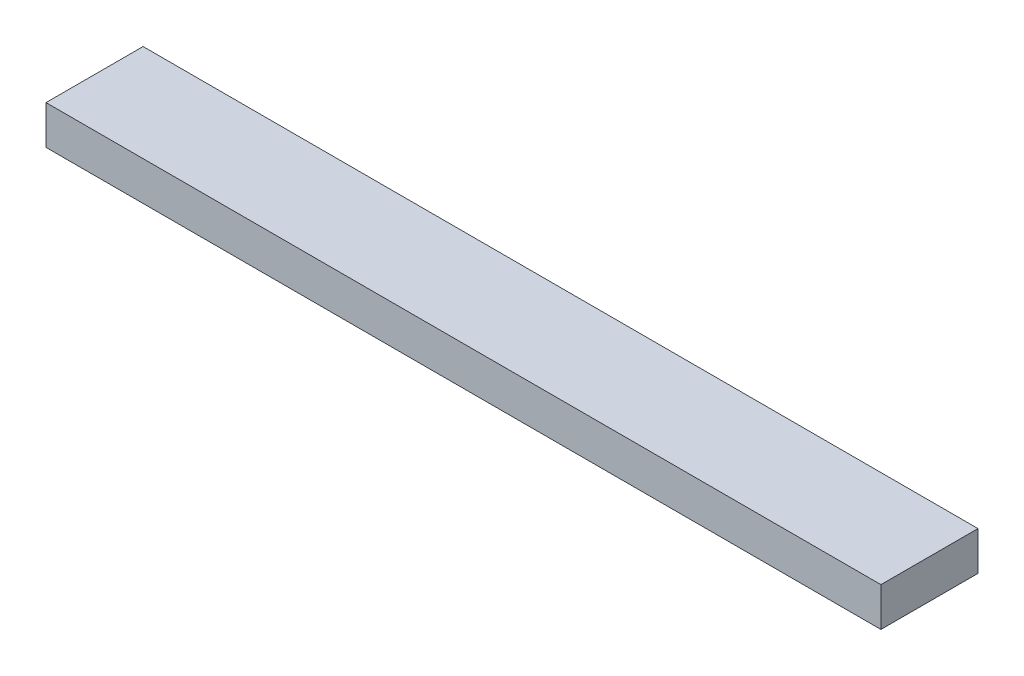
ISO-10303-21;
HEADER;
FILE_DESCRIPTION(('STEP AP214'),'2;1');
FILE_NAME('part.step','',(''),(''),'','','');
FILE_SCHEMA(('AUTOMOTIVE_DESIGN { 1 0 10303 214 1 1 1 1 }'));
ENDSEC;
DATA;
#1=APPLICATION_CONTEXT('core data for automotive mechanical design processes');
#2=APPLICATION_PROTOCOL_DEFINITION('international standard','automotive_design',2000,#1);
#3=PRODUCT_CONTEXT('',#1,'mechanical');
#4=PRODUCT('Part','Part','',(#3));
#5=PRODUCT_RELATED_PRODUCT_CATEGORY('part','',(#4));
#6=PRODUCT_DEFINITION_FORMATION('','',#4);
#7=PRODUCT_DEFINITION_CONTEXT('part definition',#1,'design');
#8=PRODUCT_DEFINITION('design','',#6,#7);
#9=PRODUCT_DEFINITION_SHAPE('','',#8);
#10=(LENGTH_UNIT() NAMED_UNIT(*) SI_UNIT(.MILLI.,.METRE.));
#11=(NAMED_UNIT(*) PLANE_ANGLE_UNIT() SI_UNIT($,.RADIAN.));
#12=(NAMED_UNIT(*) SI_UNIT($,.STERADIAN.) SOLID_ANGLE_UNIT());
#13=UNCERTAINTY_MEASURE_WITH_UNIT(LENGTH_MEASURE(1.E-05),#10,'distance_accuracy_value','');
#14=(GEOMETRIC_REPRESENTATION_CONTEXT(3) GLOBAL_UNCERTAINTY_ASSIGNED_CONTEXT((#13)) GLOBAL_UNIT_ASSIGNED_CONTEXT((#10,
#11,#12)) REPRESENTATION_CONTEXT('',''));
#15=CARTESIAN_POINT('',(0.,0.,0.));
#16=DIRECTION('',(0.,0.,1.));
#17=DIRECTION('',(1.,0.,0.));
#18=AXIS2_PLACEMENT_3D('',#15,#16,#17);
#19=CARTESIAN_POINT('',(1092.2,0.,0.));
#20=DIRECTION('',(0.,0.,-1.));
#21=DIRECTION('',(-1.,0.,0.));
#22=AXIS2_PLACEMENT_3D('',#19,#20,#21);
#23=PLANE('',#22);
#24=DIRECTION('',(0.,-1.,0.));
#25=VECTOR('',#24,1.);
#26=CARTESIAN_POINT('',(0.,0.,0.));
#27=LINE('',#26,#25);
#28=CARTESIAN_POINT('',(0.,50.8,0.));
#29=VERTEX_POINT('',#28);
#30=CARTESIAN_POINT('',(0.,0.,0.));
#31=VERTEX_POINT('',#30);
#32=EDGE_CURVE('E97',#29,#31,#27,.T.);
#33=ORIENTED_EDGE('',*,*,#32,.T.);
#34=DIRECTION('',(-1.,0.,0.));
#35=VECTOR('',#34,1.);
#36=CARTESIAN_POINT('',(1092.2,0.,0.));
#37=LINE('',#36,#35);
#38=CARTESIAN_POINT('',(1092.2,0.,0.));
#39=VERTEX_POINT('',#38);
#40=EDGE_CURVE('E11',#39,#31,#37,.T.);
#41=ORIENTED_EDGE('',*,*,#40,.F.);
#42=DIRECTION('',(0.,-1.,0.));
#43=VECTOR('',#42,1.);
#44=CARTESIAN_POINT('',(1092.2,0.,0.));
#45=LINE('',#44,#43);
#46=CARTESIAN_POINT('',(1092.2,50.8,0.));
#47=VERTEX_POINT('',#46);
#48=EDGE_CURVE('E85',#47,#39,#45,.T.);
#49=ORIENTED_EDGE('',*,*,#48,.F.);
#50=DIRECTION('',(-1.,0.,0.));
#51=VECTOR('',#50,1.);
#52=CARTESIAN_POINT('',(1092.2,50.8,0.));
#53=LINE('',#52,#51);
#54=EDGE_CURVE('E93',#47,#29,#53,.T.);
#55=ORIENTED_EDGE('',*,*,#54,.T.);
#56=EDGE_LOOP('',(#33,#41,#49,#55));
#57=FACE_BOUND('',#56,.T.);
#58=ADVANCED_FACE('F34',(#57),#23,.F.);
#59=CARTESIAN_POINT('',(1092.2,0.,0.));
#60=DIRECTION('',(0.,1.,0.));
#61=DIRECTION('',(0.,0.,1.));
#62=AXIS2_PLACEMENT_3D('',#59,#60,#61);
#63=PLANE('',#62);
#64=DIRECTION('',(0.,0.,-1.));
#65=VECTOR('',#64,1.);
#66=CARTESIAN_POINT('',(0.,0.,0.));
#67=LINE('',#66,#65);
#68=CARTESIAN_POINT('',(0.,0.,-127.));
#69=VERTEX_POINT('',#68);
#70=EDGE_CURVE('E89',#31,#69,#67,.T.);
#71=ORIENTED_EDGE('',*,*,#70,.T.);
#72=DIRECTION('',(-1.,0.,0.));
#73=VECTOR('',#72,1.);
#74=CARTESIAN_POINT('',(1092.2,0.,-127.));
#75=LINE('',#74,#73);
#76=CARTESIAN_POINT('',(1092.2,0.,-127.));
#77=VERTEX_POINT('',#76);
#78=EDGE_CURVE('E42',#77,#69,#75,.T.);
#79=ORIENTED_EDGE('',*,*,#78,.F.);
#80=DIRECTION('',(0.,0.,-1.));
#81=VECTOR('',#80,1.);
#82=CARTESIAN_POINT('',(1092.2,0.,0.));
#83=LINE('',#82,#81);
#84=EDGE_CURVE('E80',#39,#77,#83,.T.);
#85=ORIENTED_EDGE('',*,*,#84,.F.);
#86=ORIENTED_EDGE('',*,*,#40,.T.);
#87=EDGE_LOOP('',(#71,#79,#85,#86));
#88=FACE_BOUND('',#87,.T.);
#89=ADVANCED_FACE('F88',(#88),#63,.F.);
#90=CARTESIAN_POINT('',(1092.2,0.,-127.));
#91=DIRECTION('',(0.,0.,1.));
#92=DIRECTION('',(1.,0.,0.));
#93=AXIS2_PLACEMENT_3D('',#90,#91,#92);
#94=PLANE('',#93);
#95=DIRECTION('',(0.,1.,0.));
#96=VECTOR('',#95,1.);
#97=CARTESIAN_POINT('',(0.,0.,-127.));
#98=LINE('',#97,#96);
#99=CARTESIAN_POINT('',(0.,50.8,-127.));
#100=VERTEX_POINT('',#99);
#101=EDGE_CURVE('E67',#69,#100,#98,.T.);
#102=ORIENTED_EDGE('',*,*,#101,.T.);
#103=DIRECTION('',(-1.,0.,0.));
#104=VECTOR('',#103,1.);
#105=CARTESIAN_POINT('',(1092.2,50.8,-127.));
#106=LINE('',#105,#104);
#107=CARTESIAN_POINT('',(1092.2,50.8,-127.));
#108=VERTEX_POINT('',#107);
#109=EDGE_CURVE('E90',#108,#100,#106,.T.);
#110=ORIENTED_EDGE('',*,*,#109,.F.);
#111=DIRECTION('',(0.,1.,0.));
#112=VECTOR('',#111,1.);
#113=CARTESIAN_POINT('',(1092.2,0.,-127.));
#114=LINE('',#113,#112);
#115=EDGE_CURVE('E83',#77,#108,#114,.T.);
#116=ORIENTED_EDGE('',*,*,#115,.F.);
#117=ORIENTED_EDGE('',*,*,#78,.T.);
#118=EDGE_LOOP('',(#102,#110,#116,#117));
#119=FACE_BOUND('',#118,.T.);
#120=ADVANCED_FACE('F91',(#119),#94,.F.);
#121=CARTESIAN_POINT('',(1092.2,50.8,0.));
#122=DIRECTION('',(0.,-1.,0.));
#123=DIRECTION('',(0.,0.,-1.));
#124=AXIS2_PLACEMENT_3D('',#121,#122,#123);
#125=PLANE('',#124);
#126=DIRECTION('',(0.,0.,1.));
#127=VECTOR('',#126,1.);
#128=CARTESIAN_POINT('',(0.,50.8,0.));
#129=LINE('',#128,#127);
#130=EDGE_CURVE('E73',#100,#29,#129,.T.);
#131=ORIENTED_EDGE('',*,*,#130,.T.);
#132=ORIENTED_EDGE('',*,*,#54,.F.);
#133=DIRECTION('',(0.,0.,1.));
#134=VECTOR('',#133,1.);
#135=CARTESIAN_POINT('',(1092.2,50.8,0.));
#136=LINE('',#135,#134);
#137=EDGE_CURVE('E50',#108,#47,#136,.T.);
#138=ORIENTED_EDGE('',*,*,#137,.F.);
#139=ORIENTED_EDGE('',*,*,#109,.T.);
#140=EDGE_LOOP('',(#131,#132,#138,#139));
#141=FACE_BOUND('',#140,.T.);
#142=ADVANCED_FACE('F104',(#141),#125,.F.);
#143=CARTESIAN_POINT('',(1092.2,0.,0.));
#144=DIRECTION('',(-1.,0.,0.));
#145=DIRECTION('',(0.,0.,1.));
#146=AXIS2_PLACEMENT_3D('',#143,#144,#145);
#147=PLANE('',#146);
#148=ORIENTED_EDGE('',*,*,#48,.T.);
#149=ORIENTED_EDGE('',*,*,#84,.T.);
#150=ORIENTED_EDGE('',*,*,#115,.T.);
#151=ORIENTED_EDGE('',*,*,#137,.T.);
#152=EDGE_LOOP('',(#148,#149,#150,#151));
#153=FACE_BOUND('',#152,.T.);
#154=ADVANCED_FACE('F81',(#153),#147,.F.);
#155=CARTESIAN_POINT('',(0.,0.,0.));
#156=DIRECTION('',(-1.,0.,0.));
#157=DIRECTION('',(0.,0.,1.));
#158=AXIS2_PLACEMENT_3D('',#155,#156,#157);
#159=PLANE('',#158);
#160=ORIENTED_EDGE('',*,*,#32,.F.);
#161=ORIENTED_EDGE('',*,*,#130,.F.);
#162=ORIENTED_EDGE('',*,*,#101,.F.);
#163=ORIENTED_EDGE('',*,*,#70,.F.);
#164=EDGE_LOOP('',(#160,#161,#162,#163));
#165=FACE_BOUND('',#164,.T.);
#166=ADVANCED_FACE('F107',(#165),#159,.T.);
#167=CLOSED_SHELL('',(#58,#89,#120,#142,#154,#166));
#168=MANIFOLD_SOLID_BREP('B2',#167);
#169=ADVANCED_BREP_SHAPE_REPRESENTATION('',(#18,#168),#14);
#170=SHAPE_DEFINITION_REPRESENTATION(#9,#169);
ENDSEC;
END-ISO-10303-21;
